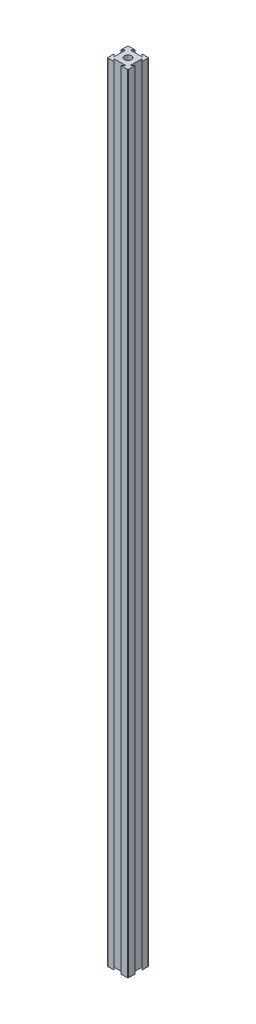
ISO-10303-21;
HEADER;
FILE_DESCRIPTION(('STEP AP214'),'2;1');
FILE_NAME('part.step','',(''),(''),'','','');
FILE_SCHEMA(('AUTOMOTIVE_DESIGN { 1 0 10303 214 1 1 1 1 }'));
ENDSEC;
DATA;
#1=APPLICATION_CONTEXT('core data for automotive mechanical design processes');
#2=APPLICATION_PROTOCOL_DEFINITION('international standard','automotive_design',2000,#1);
#3=PRODUCT_CONTEXT('',#1,'mechanical');
#4=PRODUCT('Part','Part','',(#3));
#5=PRODUCT_RELATED_PRODUCT_CATEGORY('part','',(#4));
#6=PRODUCT_DEFINITION_FORMATION('','',#4);
#7=PRODUCT_DEFINITION_CONTEXT('part definition',#1,'design');
#8=PRODUCT_DEFINITION('design','',#6,#7);
#9=PRODUCT_DEFINITION_SHAPE('','',#8);
#10=(LENGTH_UNIT() NAMED_UNIT(*) SI_UNIT(.MILLI.,.METRE.));
#11=(NAMED_UNIT(*) PLANE_ANGLE_UNIT() SI_UNIT($,.RADIAN.));
#12=(NAMED_UNIT(*) SI_UNIT($,.STERADIAN.) SOLID_ANGLE_UNIT());
#13=UNCERTAINTY_MEASURE_WITH_UNIT(LENGTH_MEASURE(1.E-05),#10,'distance_accuracy_value','');
#14=(GEOMETRIC_REPRESENTATION_CONTEXT(3) GLOBAL_UNCERTAINTY_ASSIGNED_CONTEXT((#13)) GLOBAL_UNIT_ASSIGNED_CONTEXT((#10,
#11,#12)) REPRESENTATION_CONTEXT('',''));
#15=CARTESIAN_POINT('',(0.,0.,0.));
#16=DIRECTION('',(0.,0.,1.));
#17=DIRECTION('',(1.,0.,0.));
#18=AXIS2_PLACEMENT_3D('',#15,#16,#17);
#19=CARTESIAN_POINT('',(16.6666666666667,762.,-16.6666666666667));
#20=DIRECTION('',(-0.707106781186547,0.,0.707106781186548));
#21=DIRECTION('',(0.707106781186548,0.,0.707106781186547));
#22=AXIS2_PLACEMENT_3D('',#19,#20,#21);
#23=PLANE('',#22);
#24=DIRECTION('',(-0.707106781186548,0.,-0.707106781186547));
#25=VECTOR('',#24,1.);
#26=CARTESIAN_POINT('',(16.6666666666667,0.,-16.6666666666667));
#27=LINE('',#26,#25);
#28=CARTESIAN_POINT('',(20.,0.,-13.3333333333333));
#29=VERTEX_POINT('',#28);
#30=CARTESIAN_POINT('',(17.6183333333333,0.,-15.715));
#31=VERTEX_POINT('',#30);
#32=EDGE_CURVE('E201',#29,#31,#27,.T.);
#33=ORIENTED_EDGE('',*,*,#32,.F.);
#34=DIRECTION('',(0.,-1.,0.));
#35=VECTOR('',#34,1.);
#36=CARTESIAN_POINT('',(20.,762.,-13.3333333333333));
#37=LINE('',#36,#35);
#38=CARTESIAN_POINT('',(20.,762.,-13.3333333333333));
#39=VERTEX_POINT('',#38);
#40=EDGE_CURVE('E195',#39,#29,#37,.T.);
#41=ORIENTED_EDGE('',*,*,#40,.F.);
#42=DIRECTION('',(-0.707106781186548,0.,-0.707106781186547));
#43=VECTOR('',#42,1.);
#44=CARTESIAN_POINT('',(16.6666666666667,762.,-16.6666666666667));
#45=LINE('',#44,#43);
#46=CARTESIAN_POINT('',(17.6183333333333,762.,-15.715));
#47=VERTEX_POINT('',#46);
#48=EDGE_CURVE('E198',#39,#47,#45,.T.);
#49=ORIENTED_EDGE('',*,*,#48,.T.);
#50=DIRECTION('',(0.,-1.,0.));
#51=VECTOR('',#50,1.);
#52=CARTESIAN_POINT('',(17.6183333333333,762.,-15.715));
#53=LINE('',#52,#51);
#54=EDGE_CURVE('E269',#47,#31,#53,.T.);
#55=ORIENTED_EDGE('',*,*,#54,.T.);
#56=EDGE_LOOP('',(#33,#41,#49,#55));
#57=FACE_BOUND('',#56,.T.);
#58=ADVANCED_FACE('F35',(#57),#23,.T.);
#59=CARTESIAN_POINT('',(20.,762.,0.));
#60=DIRECTION('',(-1.,0.,0.));
#61=DIRECTION('',(0.,0.,1.));
#62=AXIS2_PLACEMENT_3D('',#59,#60,#61);
#63=PLANE('',#62);
#64=DIRECTION('',(0.,0.,-1.));
#65=VECTOR('',#64,1.);
#66=CARTESIAN_POINT('',(20.,0.,0.));
#67=LINE('',#66,#65);
#68=CARTESIAN_POINT('',(20.,0.,-19.492));
#69=VERTEX_POINT('',#68);
#70=EDGE_CURVE('E274',#29,#69,#67,.T.);
#71=ORIENTED_EDGE('',*,*,#70,.T.);
#72=DIRECTION('',(0.,-1.,0.));
#73=VECTOR('',#72,1.);
#74=CARTESIAN_POINT('',(20.,762.,-19.492));
#75=LINE('',#74,#73);
#76=CARTESIAN_POINT('',(20.,762.,-19.492));
#77=VERTEX_POINT('',#76);
#78=EDGE_CURVE('E212',#69,#77,#75,.F.);
#79=ORIENTED_EDGE('',*,*,#78,.T.);
#80=DIRECTION('',(0.,0.,-1.));
#81=VECTOR('',#80,1.);
#82=CARTESIAN_POINT('',(20.,762.,0.));
#83=LINE('',#82,#81);
#84=EDGE_CURVE('E209',#39,#77,#83,.T.);
#85=ORIENTED_EDGE('',*,*,#84,.F.);
#86=ORIENTED_EDGE('',*,*,#40,.T.);
#87=EDGE_LOOP('',(#71,#79,#85,#86));
#88=FACE_BOUND('',#87,.T.);
#89=ADVANCED_FACE('F210',(#88),#63,.F.);
#90=CARTESIAN_POINT('',(0.,762.,-20.));
#91=DIRECTION('',(0.,0.,-1.));
#92=DIRECTION('',(-1.,0.,0.));
#93=AXIS2_PLACEMENT_3D('',#90,#91,#92);
#94=PLANE('',#93);
#95=DIRECTION('',(1.,0.,0.));
#96=VECTOR('',#95,1.);
#97=CARTESIAN_POINT('',(0.,762.,-20.));
#98=LINE('',#97,#96);
#99=CARTESIAN_POINT('',(13.3333333333333,762.,-20.));
#100=VERTEX_POINT('',#99);
#101=CARTESIAN_POINT('',(19.492,762.,-20.));
#102=VERTEX_POINT('',#101);
#103=EDGE_CURVE('E214',#100,#102,#98,.T.);
#104=ORIENTED_EDGE('',*,*,#103,.T.);
#105=DIRECTION('',(0.,-1.,0.));
#106=VECTOR('',#105,1.);
#107=CARTESIAN_POINT('',(19.492,0.,-20.));
#108=LINE('',#107,#106);
#109=CARTESIAN_POINT('',(19.492,0.,-20.));
#110=VERTEX_POINT('',#109);
#111=EDGE_CURVE('E376',#102,#110,#108,.T.);
#112=ORIENTED_EDGE('',*,*,#111,.T.);
#113=DIRECTION('',(1.,0.,0.));
#114=VECTOR('',#113,1.);
#115=CARTESIAN_POINT('',(0.,0.,-20.));
#116=LINE('',#115,#114);
#117=CARTESIAN_POINT('',(13.3333333333333,0.,-20.));
#118=VERTEX_POINT('',#117);
#119=EDGE_CURVE('E276',#118,#110,#116,.T.);
#120=ORIENTED_EDGE('',*,*,#119,.F.);
#121=DIRECTION('',(0.,-1.,0.));
#122=VECTOR('',#121,1.);
#123=CARTESIAN_POINT('',(13.3333333333333,762.,-20.));
#124=LINE('',#123,#122);
#125=EDGE_CURVE('E206',#100,#118,#124,.T.);
#126=ORIENTED_EDGE('',*,*,#125,.F.);
#127=EDGE_LOOP('',(#104,#112,#120,#126));
#128=FACE_BOUND('',#127,.T.);
#129=ADVANCED_FACE('F408',(#128),#94,.T.);
#130=CARTESIAN_POINT('',(16.6666666666666,762.,-16.6666666666668));
#131=DIRECTION('',(-0.707106781186544,0.,0.707106781186551));
#132=DIRECTION('',(0.707106781186551,0.,0.707106781186544));
#133=AXIS2_PLACEMENT_3D('',#130,#131,#132);
#134=PLANE('',#133);
#135=DIRECTION('',(-0.707106781186551,0.,-0.707106781186544));
#136=VECTOR('',#135,1.);
#137=CARTESIAN_POINT('',(16.6666666666666,0.,-16.6666666666668));
#138=LINE('',#137,#136);
#139=CARTESIAN_POINT('',(15.715,0.,-17.6183333333334));
#140=VERTEX_POINT('',#139);
#141=EDGE_CURVE('E280',#140,#118,#138,.T.);
#142=ORIENTED_EDGE('',*,*,#141,.F.);
#143=DIRECTION('',(0.,-1.,0.));
#144=VECTOR('',#143,1.);
#145=CARTESIAN_POINT('',(15.715,762.,-17.6183333333334));
#146=LINE('',#145,#144);
#147=CARTESIAN_POINT('',(15.715,762.,-17.6183333333334));
#148=VERTEX_POINT('',#147);
#149=EDGE_CURVE('E354',#148,#140,#146,.T.);
#150=ORIENTED_EDGE('',*,*,#149,.F.);
#151=DIRECTION('',(-0.707106781186551,0.,-0.707106781186544));
#152=VECTOR('',#151,1.);
#153=CARTESIAN_POINT('',(16.6666666666666,762.,-16.6666666666668));
#154=LINE('',#153,#152);
#155=EDGE_CURVE('E230',#148,#100,#154,.T.);
#156=ORIENTED_EDGE('',*,*,#155,.T.);
#157=ORIENTED_EDGE('',*,*,#125,.T.);
#158=EDGE_LOOP('',(#142,#150,#156,#157));
#159=FACE_BOUND('',#158,.T.);
#160=ADVANCED_FACE('F412',(#159),#134,.T.);
#161=CARTESIAN_POINT('',(0.,762.,-17.6183333333334));
#162=DIRECTION('',(0.,0.,-1.));
#163=DIRECTION('',(-1.,0.,0.));
#164=AXIS2_PLACEMENT_3D('',#161,#162,#163);
#165=PLANE('',#164);
#166=DIRECTION('',(1.,0.,0.));
#167=VECTOR('',#166,1.);
#168=CARTESIAN_POINT('',(0.,0.,-17.6183333333334));
#169=LINE('',#168,#167);
#170=CARTESIAN_POINT('',(4.285,0.,-17.6183333333334));
#171=VERTEX_POINT('',#170);
#172=EDGE_CURVE('E284',#171,#140,#169,.T.);
#173=ORIENTED_EDGE('',*,*,#172,.F.);
#174=DIRECTION('',(0.,-1.,0.));
#175=VECTOR('',#174,1.);
#176=CARTESIAN_POINT('',(4.285,762.,-17.6183333333334));
#177=LINE('',#176,#175);
#178=CARTESIAN_POINT('',(4.285,762.,-17.6183333333334));
#179=VERTEX_POINT('',#178);
#180=EDGE_CURVE('E352',#179,#171,#177,.T.);
#181=ORIENTED_EDGE('',*,*,#180,.F.);
#182=DIRECTION('',(1.,0.,0.));
#183=VECTOR('',#182,1.);
#184=CARTESIAN_POINT('',(0.,762.,-17.6183333333334));
#185=LINE('',#184,#183);
#186=EDGE_CURVE('E234',#179,#148,#185,.T.);
#187=ORIENTED_EDGE('',*,*,#186,.T.);
#188=ORIENTED_EDGE('',*,*,#149,.T.);
#189=EDGE_LOOP('',(#173,#181,#187,#188));
#190=FACE_BOUND('',#189,.T.);
#191=ADVANCED_FACE('F439',(#190),#165,.T.);
#192=CARTESIAN_POINT('',(-6.6666666666667,762.,-6.66666666666677));
#193=DIRECTION('',(0.707106781186544,0.,0.707106781186551));
#194=DIRECTION('',(0.707106781186551,0.,-0.707106781186544));
#195=AXIS2_PLACEMENT_3D('',#192,#193,#194);
#196=PLANE('',#195);
#197=DIRECTION('',(-0.707106781186551,0.,0.707106781186544));
#198=VECTOR('',#197,1.);
#199=CARTESIAN_POINT('',(-6.6666666666667,0.,-6.66666666666677));
#200=LINE('',#199,#198);
#201=CARTESIAN_POINT('',(6.66666666666666,0.,-20.));
#202=VERTEX_POINT('',#201);
#203=EDGE_CURVE('E287',#202,#171,#200,.T.);
#204=ORIENTED_EDGE('',*,*,#203,.F.);
#205=DIRECTION('',(0.,-1.,0.));
#206=VECTOR('',#205,1.);
#207=CARTESIAN_POINT('',(6.66666666666666,762.,-20.));
#208=LINE('',#207,#206);
#209=CARTESIAN_POINT('',(6.66666666666666,762.,-20.));
#210=VERTEX_POINT('',#209);
#211=EDGE_CURVE('E349',#210,#202,#208,.T.);
#212=ORIENTED_EDGE('',*,*,#211,.F.);
#213=DIRECTION('',(-0.707106781186551,0.,0.707106781186544));
#214=VECTOR('',#213,1.);
#215=CARTESIAN_POINT('',(-6.6666666666667,762.,-6.66666666666677));
#216=LINE('',#215,#214);
#217=EDGE_CURVE('E237',#210,#179,#216,.T.);
#218=ORIENTED_EDGE('',*,*,#217,.T.);
#219=ORIENTED_EDGE('',*,*,#180,.T.);
#220=EDGE_LOOP('',(#204,#212,#218,#219));
#221=FACE_BOUND('',#220,.T.);
#222=ADVANCED_FACE('F442',(#221),#196,.T.);
#223=CARTESIAN_POINT('',(0.508,0.,-20.));
#224=VERTEX_POINT('',#223);
#225=EDGE_CURVE('E281',#224,#202,#116,.T.);
#226=ORIENTED_EDGE('',*,*,#225,.F.);
#227=DIRECTION('',(0.,-1.,0.));
#228=VECTOR('',#227,1.);
#229=CARTESIAN_POINT('',(0.508,762.,-20.));
#230=LINE('',#229,#228);
#231=CARTESIAN_POINT('',(0.508,762.,-20.));
#232=VERTEX_POINT('',#231);
#233=EDGE_CURVE('E367',#224,#232,#230,.F.);
#234=ORIENTED_EDGE('',*,*,#233,.T.);
#235=EDGE_CURVE('E231',#232,#210,#98,.T.);
#236=ORIENTED_EDGE('',*,*,#235,.T.);
#237=ORIENTED_EDGE('',*,*,#211,.T.);
#238=EDGE_LOOP('',(#226,#234,#236,#237));
#239=FACE_BOUND('',#238,.T.);
#240=ADVANCED_FACE('F505',(#239),#94,.T.);
#241=CARTESIAN_POINT('',(0.,762.,0.));
#242=DIRECTION('',(-1.,0.,0.));
#243=DIRECTION('',(0.,0.,1.));
#244=AXIS2_PLACEMENT_3D('',#241,#242,#243);
#245=PLANE('',#244);
#246=DIRECTION('',(0.,0.,-1.));
#247=VECTOR('',#246,1.);
#248=CARTESIAN_POINT('',(0.,762.,0.));
#249=LINE('',#248,#247);
#250=CARTESIAN_POINT('',(0.,762.,-13.3333333333333));
#251=VERTEX_POINT('',#250);
#252=CARTESIAN_POINT('',(0.,762.,-19.492));
#253=VERTEX_POINT('',#252);
#254=EDGE_CURVE('E240',#251,#253,#249,.T.);
#255=ORIENTED_EDGE('',*,*,#254,.T.);
#256=DIRECTION('',(0.,-1.,0.));
#257=VECTOR('',#256,1.);
#258=CARTESIAN_POINT('',(0.,762.,-19.492));
#259=LINE('',#258,#257);
#260=CARTESIAN_POINT('',(0.,0.,-19.492));
#261=VERTEX_POINT('',#260);
#262=EDGE_CURVE('E205',#253,#261,#259,.T.);
#263=ORIENTED_EDGE('',*,*,#262,.T.);
#264=DIRECTION('',(0.,0.,-1.));
#265=VECTOR('',#264,1.);
#266=CARTESIAN_POINT('',(0.,0.,0.));
#267=LINE('',#266,#265);
#268=CARTESIAN_POINT('',(0.,0.,-13.3333333333333));
#269=VERTEX_POINT('',#268);
#270=EDGE_CURVE('E290',#269,#261,#267,.T.);
#271=ORIENTED_EDGE('',*,*,#270,.F.);
#272=DIRECTION('',(0.,-1.,0.));
#273=VECTOR('',#272,1.);
#274=CARTESIAN_POINT('',(0.,762.,-13.3333333333333));
#275=LINE('',#274,#273);
#276=EDGE_CURVE('E347',#251,#269,#275,.T.);
#277=ORIENTED_EDGE('',*,*,#276,.F.);
#278=EDGE_LOOP('',(#255,#263,#271,#277));
#279=FACE_BOUND('',#278,.T.);
#280=ADVANCED_FACE('F451',(#279),#245,.T.);
#281=CARTESIAN_POINT('',(-6.66666666666667,762.,-6.66666666666669));
#282=DIRECTION('',(-0.707106781186547,0.,-0.707106781186549));
#283=DIRECTION('',(-0.707106781186549,0.,0.707106781186547));
#284=AXIS2_PLACEMENT_3D('',#281,#282,#283);
#285=PLANE('',#284);
#286=DIRECTION('',(0.707106781186549,0.,-0.707106781186547));
#287=VECTOR('',#286,1.);
#288=CARTESIAN_POINT('',(-6.66666666666667,0.,-6.66666666666669));
#289=LINE('',#288,#287);
#290=CARTESIAN_POINT('',(2.38166666666667,0.,-15.715));
#291=VERTEX_POINT('',#290);
#292=EDGE_CURVE('E293',#269,#291,#289,.T.);
#293=ORIENTED_EDGE('',*,*,#292,.T.);
#294=DIRECTION('',(0.,-1.,0.));
#295=VECTOR('',#294,1.);
#296=CARTESIAN_POINT('',(2.38166666666667,762.,-15.715));
#297=LINE('',#296,#295);
#298=CARTESIAN_POINT('',(2.38166666666667,762.,-15.715));
#299=VERTEX_POINT('',#298);
#300=EDGE_CURVE('E344',#299,#291,#297,.T.);
#301=ORIENTED_EDGE('',*,*,#300,.F.);
#302=DIRECTION('',(0.707106781186549,0.,-0.707106781186547));
#303=VECTOR('',#302,1.);
#304=CARTESIAN_POINT('',(-6.66666666666667,762.,-6.66666666666669));
#305=LINE('',#304,#303);
#306=EDGE_CURVE('E243',#251,#299,#305,.T.);
#307=ORIENTED_EDGE('',*,*,#306,.F.);
#308=ORIENTED_EDGE('',*,*,#276,.T.);
#309=EDGE_LOOP('',(#293,#301,#307,#308));
#310=FACE_BOUND('',#309,.T.);
#311=ADVANCED_FACE('F456',(#310),#285,.F.);
#312=CARTESIAN_POINT('',(2.38166666666667,762.,0.));
#313=DIRECTION('',(1.,0.,0.));
#314=DIRECTION('',(0.,0.,-1.));
#315=AXIS2_PLACEMENT_3D('',#312,#313,#314);
#316=PLANE('',#315);
#317=DIRECTION('',(0.,0.,1.));
#318=VECTOR('',#317,1.);
#319=CARTESIAN_POINT('',(2.38166666666667,0.,0.));
#320=LINE('',#319,#318);
#321=CARTESIAN_POINT('',(2.38166666666667,0.,-4.285));
#322=VERTEX_POINT('',#321);
#323=EDGE_CURVE('E297',#291,#322,#320,.T.);
#324=ORIENTED_EDGE('',*,*,#323,.T.);
#325=DIRECTION('',(0.,-1.,0.));
#326=VECTOR('',#325,1.);
#327=CARTESIAN_POINT('',(2.38166666666667,762.,-4.285));
#328=LINE('',#327,#326);
#329=CARTESIAN_POINT('',(2.38166666666667,762.,-4.285));
#330=VERTEX_POINT('',#329);
#331=EDGE_CURVE('E341',#330,#322,#328,.T.);
#332=ORIENTED_EDGE('',*,*,#331,.F.);
#333=DIRECTION('',(0.,0.,1.));
#334=VECTOR('',#333,1.);
#335=CARTESIAN_POINT('',(2.38166666666667,762.,0.));
#336=LINE('',#335,#334);
#337=EDGE_CURVE('E247',#299,#330,#336,.T.);
#338=ORIENTED_EDGE('',*,*,#337,.F.);
#339=ORIENTED_EDGE('',*,*,#300,.T.);
#340=EDGE_LOOP('',(#324,#332,#338,#339));
#341=FACE_BOUND('',#340,.T.);
#342=ADVANCED_FACE('F462',(#341),#316,.F.);
#343=CARTESIAN_POINT('',(3.33333333333333,762.,-3.33333333333335));
#344=DIRECTION('',(-0.707106781186546,0.,0.707106781186549));
#345=DIRECTION('',(0.707106781186549,0.,0.707106781186546));
#346=AXIS2_PLACEMENT_3D('',#343,#344,#345);
#347=PLANE('',#346);
#348=DIRECTION('',(-0.707106781186549,0.,-0.707106781186546));
#349=VECTOR('',#348,1.);
#350=CARTESIAN_POINT('',(3.33333333333333,0.,-3.33333333333335));
#351=LINE('',#350,#349);
#352=CARTESIAN_POINT('',(0.,0.,-6.66666666666667));
#353=VERTEX_POINT('',#352);
#354=EDGE_CURVE('E300',#322,#353,#351,.T.);
#355=ORIENTED_EDGE('',*,*,#354,.T.);
#356=DIRECTION('',(0.,-1.,0.));
#357=VECTOR('',#356,1.);
#358=CARTESIAN_POINT('',(0.,762.,-6.66666666666667));
#359=LINE('',#358,#357);
#360=CARTESIAN_POINT('',(0.,762.,-6.66666666666667));
#361=VERTEX_POINT('',#360);
#362=EDGE_CURVE('E338',#361,#353,#359,.T.);
#363=ORIENTED_EDGE('',*,*,#362,.F.);
#364=DIRECTION('',(-0.707106781186549,0.,-0.707106781186546));
#365=VECTOR('',#364,1.);
#366=CARTESIAN_POINT('',(3.33333333333333,762.,-3.33333333333335));
#367=LINE('',#366,#365);
#368=EDGE_CURVE('E250',#330,#361,#367,.T.);
#369=ORIENTED_EDGE('',*,*,#368,.F.);
#370=ORIENTED_EDGE('',*,*,#331,.T.);
#371=EDGE_LOOP('',(#355,#363,#369,#370));
#372=FACE_BOUND('',#371,.T.);
#373=ADVANCED_FACE('F464',(#372),#347,.F.);
#374=CARTESIAN_POINT('',(0.,0.,-0.508));
#375=VERTEX_POINT('',#374);
#376=EDGE_CURVE('E294',#375,#353,#267,.T.);
#377=ORIENTED_EDGE('',*,*,#376,.F.);
#378=DIRECTION('',(0.,-1.,0.));
#379=VECTOR('',#378,1.);
#380=CARTESIAN_POINT('',(0.,762.,-0.508));
#381=LINE('',#380,#379);
#382=CARTESIAN_POINT('',(0.,762.,-0.508));
#383=VERTEX_POINT('',#382);
#384=EDGE_CURVE('E383',#375,#383,#381,.F.);
#385=ORIENTED_EDGE('',*,*,#384,.T.);
#386=EDGE_CURVE('E244',#383,#361,#249,.T.);
#387=ORIENTED_EDGE('',*,*,#386,.T.);
#388=ORIENTED_EDGE('',*,*,#362,.T.);
#389=EDGE_LOOP('',(#377,#385,#387,#388));
#390=FACE_BOUND('',#389,.T.);
#391=ADVANCED_FACE('F467',(#390),#245,.T.);
#392=CARTESIAN_POINT('',(0.,762.,0.));
#393=DIRECTION('',(0.,0.,-1.));
#394=DIRECTION('',(-1.,0.,0.));
#395=AXIS2_PLACEMENT_3D('',#392,#393,#394);
#396=PLANE('',#395);
#397=DIRECTION('',(1.,0.,0.));
#398=VECTOR('',#397,1.);
#399=CARTESIAN_POINT('',(0.,762.,0.));
#400=LINE('',#399,#398);
#401=CARTESIAN_POINT('',(0.508,762.,0.));
#402=VERTEX_POINT('',#401);
#403=CARTESIAN_POINT('',(6.66666666666667,762.,0.));
#404=VERTEX_POINT('',#403);
#405=EDGE_CURVE('E253',#402,#404,#400,.T.);
#406=ORIENTED_EDGE('',*,*,#405,.F.);
#407=DIRECTION('',(0.,-1.,0.));
#408=VECTOR('',#407,1.);
#409=CARTESIAN_POINT('',(0.508,0.,0.));
#410=LINE('',#409,#408);
#411=CARTESIAN_POINT('',(0.508,0.,0.));
#412=VERTEX_POINT('',#411);
#413=EDGE_CURVE('E380',#402,#412,#410,.T.);
#414=ORIENTED_EDGE('',*,*,#413,.T.);
#415=DIRECTION('',(1.,0.,0.));
#416=VECTOR('',#415,1.);
#417=CARTESIAN_POINT('',(0.,0.,0.));
#418=LINE('',#417,#416);
#419=CARTESIAN_POINT('',(6.66666666666667,0.,0.));
#420=VERTEX_POINT('',#419);
#421=EDGE_CURVE('E303',#412,#420,#418,.T.);
#422=ORIENTED_EDGE('',*,*,#421,.T.);
#423=DIRECTION('',(0.,-1.,0.));
#424=VECTOR('',#423,1.);
#425=CARTESIAN_POINT('',(6.66666666666667,762.,0.));
#426=LINE('',#425,#424);
#427=EDGE_CURVE('E335',#404,#420,#426,.T.);
#428=ORIENTED_EDGE('',*,*,#427,.F.);
#429=EDGE_LOOP('',(#406,#414,#422,#428));
#430=FACE_BOUND('',#429,.T.);
#431=ADVANCED_FACE('F474',(#430),#396,.F.);
#432=CARTESIAN_POINT('',(3.3333333333333,762.,-3.33333333333333));
#433=DIRECTION('',(-0.707106781186544,0.,0.707106781186551));
#434=DIRECTION('',(0.707106781186551,0.,0.707106781186544));
#435=AXIS2_PLACEMENT_3D('',#432,#433,#434);
#436=PLANE('',#435);
#437=DIRECTION('',(-0.707106781186551,0.,-0.707106781186544));
#438=VECTOR('',#437,1.);
#439=CARTESIAN_POINT('',(3.3333333333333,0.,-3.33333333333333));
#440=LINE('',#439,#438);
#441=CARTESIAN_POINT('',(4.285,0.,-2.38166666666664));
#442=VERTEX_POINT('',#441);
#443=EDGE_CURVE('E305',#420,#442,#440,.T.);
#444=ORIENTED_EDGE('',*,*,#443,.T.);
#445=DIRECTION('',(0.,-1.,0.));
#446=VECTOR('',#445,1.);
#447=CARTESIAN_POINT('',(4.285,762.,-2.38166666666664));
#448=LINE('',#447,#446);
#449=CARTESIAN_POINT('',(4.285,762.,-2.38166666666664));
#450=VERTEX_POINT('',#449);
#451=EDGE_CURVE('E332',#450,#442,#448,.T.);
#452=ORIENTED_EDGE('',*,*,#451,.F.);
#453=DIRECTION('',(-0.707106781186551,0.,-0.707106781186544));
#454=VECTOR('',#453,1.);
#455=CARTESIAN_POINT('',(3.3333333333333,762.,-3.33333333333333));
#456=LINE('',#455,#454);
#457=EDGE_CURVE('E255',#404,#450,#456,.T.);
#458=ORIENTED_EDGE('',*,*,#457,.F.);
#459=ORIENTED_EDGE('',*,*,#427,.T.);
#460=EDGE_LOOP('',(#444,#452,#458,#459));
#461=FACE_BOUND('',#460,.T.);
#462=ADVANCED_FACE('F480',(#461),#436,.F.);
#463=CARTESIAN_POINT('',(0.,762.,-2.38166666666664));
#464=DIRECTION('',(0.,0.,-1.));
#465=DIRECTION('',(-1.,0.,0.));
#466=AXIS2_PLACEMENT_3D('',#463,#464,#465);
#467=PLANE('',#466);
#468=DIRECTION('',(1.,0.,0.));
#469=VECTOR('',#468,1.);
#470=CARTESIAN_POINT('',(0.,0.,-2.38166666666664));
#471=LINE('',#470,#469);
#472=CARTESIAN_POINT('',(15.715,0.,-2.38166666666664));
#473=VERTEX_POINT('',#472);
#474=EDGE_CURVE('E309',#442,#473,#471,.T.);
#475=ORIENTED_EDGE('',*,*,#474,.T.);
#476=DIRECTION('',(0.,-1.,0.));
#477=VECTOR('',#476,1.);
#478=CARTESIAN_POINT('',(15.715,762.,-2.38166666666664));
#479=LINE('',#478,#477);
#480=CARTESIAN_POINT('',(15.715,762.,-2.38166666666664));
#481=VERTEX_POINT('',#480);
#482=EDGE_CURVE('E329',#481,#473,#479,.T.);
#483=ORIENTED_EDGE('',*,*,#482,.F.);
#484=DIRECTION('',(1.,0.,0.));
#485=VECTOR('',#484,1.);
#486=CARTESIAN_POINT('',(0.,762.,-2.38166666666664));
#487=LINE('',#486,#485);
#488=EDGE_CURVE('E259',#450,#481,#487,.T.);
#489=ORIENTED_EDGE('',*,*,#488,.F.);
#490=ORIENTED_EDGE('',*,*,#451,.T.);
#491=EDGE_LOOP('',(#475,#483,#489,#490));
#492=FACE_BOUND('',#491,.T.);
#493=ADVANCED_FACE('F483',(#492),#467,.F.);
#494=CARTESIAN_POINT('',(6.66666666666659,762.,6.66666666666667));
#495=DIRECTION('',(0.707106781186544,0.,0.707106781186551));
#496=DIRECTION('',(0.707106781186551,0.,-0.707106781186544));
#497=AXIS2_PLACEMENT_3D('',#494,#495,#496);
#498=PLANE('',#497);
#499=DIRECTION('',(-0.707106781186551,0.,0.707106781186544));
#500=VECTOR('',#499,1.);
#501=CARTESIAN_POINT('',(6.66666666666659,0.,6.66666666666667));
#502=LINE('',#501,#500);
#503=CARTESIAN_POINT('',(13.3333333333333,0.,0.));
#504=VERTEX_POINT('',#503);
#505=EDGE_CURVE('E312',#473,#504,#502,.T.);
#506=ORIENTED_EDGE('',*,*,#505,.T.);
#507=DIRECTION('',(0.,-1.,0.));
#508=VECTOR('',#507,1.);
#509=CARTESIAN_POINT('',(13.3333333333333,762.,0.));
#510=LINE('',#509,#508);
#511=CARTESIAN_POINT('',(13.3333333333333,762.,0.));
#512=VERTEX_POINT('',#511);
#513=EDGE_CURVE('E326',#512,#504,#510,.T.);
#514=ORIENTED_EDGE('',*,*,#513,.F.);
#515=DIRECTION('',(-0.707106781186551,0.,0.707106781186544));
#516=VECTOR('',#515,1.);
#517=CARTESIAN_POINT('',(6.66666666666659,762.,6.66666666666667));
#518=LINE('',#517,#516);
#519=EDGE_CURVE('E262',#481,#512,#518,.T.);
#520=ORIENTED_EDGE('',*,*,#519,.F.);
#521=ORIENTED_EDGE('',*,*,#482,.T.);
#522=EDGE_LOOP('',(#506,#514,#520,#521));
#523=FACE_BOUND('',#522,.T.);
#524=ADVANCED_FACE('F485',(#523),#498,.F.);
#525=CARTESIAN_POINT('',(19.492,0.,0.));
#526=VERTEX_POINT('',#525);
#527=EDGE_CURVE('E306',#504,#526,#418,.T.);
#528=ORIENTED_EDGE('',*,*,#527,.T.);
#529=DIRECTION('',(0.,-1.,0.));
#530=VECTOR('',#529,1.);
#531=CARTESIAN_POINT('',(19.492,762.,0.));
#532=LINE('',#531,#530);
#533=CARTESIAN_POINT('',(19.492,762.,0.));
#534=VERTEX_POINT('',#533);
#535=EDGE_CURVE('E11',#526,#534,#532,.F.);
#536=ORIENTED_EDGE('',*,*,#535,.T.);
#537=EDGE_CURVE('E256',#512,#534,#400,.T.);
#538=ORIENTED_EDGE('',*,*,#537,.F.);
#539=ORIENTED_EDGE('',*,*,#513,.T.);
#540=EDGE_LOOP('',(#528,#536,#538,#539));
#541=FACE_BOUND('',#540,.T.);
#542=ADVANCED_FACE('F394',(#541),#396,.F.);
#543=CARTESIAN_POINT('',(20.,762.,-0.508));
#544=VERTEX_POINT('',#543);
#545=CARTESIAN_POINT('',(20.,762.,-6.66666666666667));
#546=VERTEX_POINT('',#545);
#547=EDGE_CURVE('E216',#544,#546,#83,.T.);
#548=ORIENTED_EDGE('',*,*,#547,.F.);
#549=DIRECTION('',(0.,-1.,0.));
#550=VECTOR('',#549,1.);
#551=CARTESIAN_POINT('',(20.,762.,-0.508));
#552=LINE('',#551,#550);
#553=CARTESIAN_POINT('',(20.,0.,-0.508));
#554=VERTEX_POINT('',#553);
#555=EDGE_CURVE('E43',#544,#554,#552,.T.);
#556=ORIENTED_EDGE('',*,*,#555,.T.);
#557=CARTESIAN_POINT('',(20.,0.,-6.66666666666667));
#558=VERTEX_POINT('',#557);
#559=EDGE_CURVE('E277',#554,#558,#67,.T.);
#560=ORIENTED_EDGE('',*,*,#559,.T.);
#561=DIRECTION('',(0.,-1.,0.));
#562=VECTOR('',#561,1.);
#563=CARTESIAN_POINT('',(20.,762.,-6.66666666666667));
#564=LINE('',#563,#562);
#565=EDGE_CURVE('E323',#546,#558,#564,.T.);
#566=ORIENTED_EDGE('',*,*,#565,.F.);
#567=EDGE_LOOP('',(#548,#556,#560,#566));
#568=FACE_BOUND('',#567,.T.);
#569=ADVANCED_FACE('F388',(#568),#63,.F.);
#570=CARTESIAN_POINT('',(6.66666666666663,762.,6.66666666666666));
#571=DIRECTION('',(-0.707106781186546,0.,-0.707106781186549));
#572=DIRECTION('',(-0.707106781186549,0.,0.707106781186546));
#573=AXIS2_PLACEMENT_3D('',#570,#571,#572);
#574=PLANE('',#573);
#575=DIRECTION('',(0.707106781186549,0.,-0.707106781186546));
#576=VECTOR('',#575,1.);
#577=CARTESIAN_POINT('',(6.66666666666663,0.,6.66666666666666));
#578=LINE('',#577,#576);
#579=CARTESIAN_POINT('',(17.6183333333333,0.,-4.285));
#580=VERTEX_POINT('',#579);
#581=EDGE_CURVE('E315',#580,#558,#578,.T.);
#582=ORIENTED_EDGE('',*,*,#581,.F.);
#583=DIRECTION('',(0.,-1.,0.));
#584=VECTOR('',#583,1.);
#585=CARTESIAN_POINT('',(17.6183333333333,762.,-4.285));
#586=LINE('',#585,#584);
#587=CARTESIAN_POINT('',(17.6183333333333,762.,-4.285));
#588=VERTEX_POINT('',#587);
#589=EDGE_CURVE('E321',#588,#580,#586,.T.);
#590=ORIENTED_EDGE('',*,*,#589,.F.);
#591=DIRECTION('',(0.707106781186549,0.,-0.707106781186546));
#592=VECTOR('',#591,1.);
#593=CARTESIAN_POINT('',(6.66666666666663,762.,6.66666666666666));
#594=LINE('',#593,#592);
#595=EDGE_CURVE('E265',#588,#546,#594,.T.);
#596=ORIENTED_EDGE('',*,*,#595,.T.);
#597=ORIENTED_EDGE('',*,*,#565,.T.);
#598=EDGE_LOOP('',(#582,#590,#596,#597));
#599=FACE_BOUND('',#598,.T.);
#600=ADVANCED_FACE('F418',(#599),#574,.T.);
#601=CARTESIAN_POINT('',(10.,762.,-10.));
#602=DIRECTION('',(0.,-1.,0.));
#603=DIRECTION('',(0.,0.,-1.));
#604=AXIS2_PLACEMENT_3D('',#601,#602,#603);
#605=CYLINDRICAL_SURFACE('',#604,3.33333333333333);
#606=CARTESIAN_POINT('',(10.,762.,-10.));
#607=DIRECTION('',(0.,1.,0.));
#608=DIRECTION('',(0.,0.,1.));
#609=AXIS2_PLACEMENT_3D('',#606,#607,#608);
#610=CIRCLE('',#609,3.33333333333333);
#611=CARTESIAN_POINT('',(10.,762.,-6.66666666666667));
#612=VERTEX_POINT('',#611);
#613=EDGE_CURVE('E222',#612,#612,#610,.T.);
#614=ORIENTED_EDGE('',*,*,#613,.T.);
#615=EDGE_LOOP('',(#614));
#616=FACE_BOUND('',#615,.T.);
#617=CARTESIAN_POINT('',(10.,0.,-10.));
#618=DIRECTION('',(0.,1.,0.));
#619=DIRECTION('',(0.,0.,1.));
#620=AXIS2_PLACEMENT_3D('',#617,#618,#619);
#621=CIRCLE('',#620,3.33333333333333);
#622=CARTESIAN_POINT('',(10.,0.,-6.66666666666667));
#623=VERTEX_POINT('',#622);
#624=EDGE_CURVE('E270',#623,#623,#621,.T.);
#625=ORIENTED_EDGE('',*,*,#624,.F.);
#626=EDGE_LOOP('',(#625));
#627=FACE_BOUND('',#626,.T.);
#628=ADVANCED_FACE('F414',(#616,#627),#605,.F.);
#629=CARTESIAN_POINT('',(17.6183333333333,762.,0.));
#630=DIRECTION('',(1.,0.,0.));
#631=DIRECTION('',(0.,0.,-1.));
#632=AXIS2_PLACEMENT_3D('',#629,#630,#631);
#633=PLANE('',#632);
#634=DIRECTION('',(0.,0.,1.));
#635=VECTOR('',#634,1.);
#636=CARTESIAN_POINT('',(17.6183333333333,0.,0.));
#637=LINE('',#636,#635);
#638=EDGE_CURVE('E225',#31,#580,#637,.T.);
#639=ORIENTED_EDGE('',*,*,#638,.F.);
#640=ORIENTED_EDGE('',*,*,#54,.F.);
#641=DIRECTION('',(0.,0.,1.));
#642=VECTOR('',#641,1.);
#643=CARTESIAN_POINT('',(17.6183333333333,762.,0.));
#644=LINE('',#643,#642);
#645=EDGE_CURVE('E221',#47,#588,#644,.T.);
#646=ORIENTED_EDGE('',*,*,#645,.T.);
#647=ORIENTED_EDGE('',*,*,#589,.T.);
#648=EDGE_LOOP('',(#639,#640,#646,#647));
#649=FACE_BOUND('',#648,.T.);
#650=ADVANCED_FACE('F417',(#649),#633,.T.);
#651=CARTESIAN_POINT('',(0.,762.,0.));
#652=DIRECTION('',(0.,1.,0.));
#653=DIRECTION('',(0.,0.,1.));
#654=AXIS2_PLACEMENT_3D('',#651,#652,#653);
#655=PLANE('',#654);
#656=ORIENTED_EDGE('',*,*,#613,.F.);
#657=EDGE_LOOP('',(#656));
#658=FACE_BOUND('',#657,.T.);
#659=ORIENTED_EDGE('',*,*,#235,.F.);
#660=CARTESIAN_POINT('',(0.508,762.,-19.492));
#661=DIRECTION('',(0.,1.,0.));
#662=DIRECTION('',(0.,0.,1.));
#663=AXIS2_PLACEMENT_3D('',#660,#661,#662);
#664=CIRCLE('',#663,0.508);
#665=EDGE_CURVE('E374',#232,#253,#664,.T.);
#666=ORIENTED_EDGE('',*,*,#665,.T.);
#667=ORIENTED_EDGE('',*,*,#254,.F.);
#668=ORIENTED_EDGE('',*,*,#306,.T.);
#669=ORIENTED_EDGE('',*,*,#337,.T.);
#670=ORIENTED_EDGE('',*,*,#368,.T.);
#671=ORIENTED_EDGE('',*,*,#386,.F.);
#672=CARTESIAN_POINT('',(0.508,762.,-0.508));
#673=DIRECTION('',(0.,1.,0.));
#674=DIRECTION('',(0.,0.,1.));
#675=AXIS2_PLACEMENT_3D('',#672,#673,#674);
#676=CIRCLE('',#675,0.508);
#677=EDGE_CURVE('E370',#383,#402,#676,.T.);
#678=ORIENTED_EDGE('',*,*,#677,.T.);
#679=ORIENTED_EDGE('',*,*,#405,.T.);
#680=ORIENTED_EDGE('',*,*,#457,.T.);
#681=ORIENTED_EDGE('',*,*,#488,.T.);
#682=ORIENTED_EDGE('',*,*,#519,.T.);
#683=ORIENTED_EDGE('',*,*,#537,.T.);
#684=CARTESIAN_POINT('',(19.492,762.,-0.508));
#685=DIRECTION('',(0.,1.,0.));
#686=DIRECTION('',(0.,0.,1.));
#687=AXIS2_PLACEMENT_3D('',#684,#685,#686);
#688=CIRCLE('',#687,0.508);
#689=EDGE_CURVE('E50',#534,#544,#688,.T.);
#690=ORIENTED_EDGE('',*,*,#689,.T.);
#691=ORIENTED_EDGE('',*,*,#547,.T.);
#692=ORIENTED_EDGE('',*,*,#595,.F.);
#693=ORIENTED_EDGE('',*,*,#645,.F.);
#694=ORIENTED_EDGE('',*,*,#48,.F.);
#695=ORIENTED_EDGE('',*,*,#84,.T.);
#696=CARTESIAN_POINT('',(19.492,762.,-19.492));
#697=DIRECTION('',(0.,1.,0.));
#698=DIRECTION('',(0.,0.,1.));
#699=AXIS2_PLACEMENT_3D('',#696,#697,#698);
#700=CIRCLE('',#699,0.508);
#701=EDGE_CURVE('E372',#77,#102,#700,.T.);
#702=ORIENTED_EDGE('',*,*,#701,.T.);
#703=ORIENTED_EDGE('',*,*,#103,.F.);
#704=ORIENTED_EDGE('',*,*,#155,.F.);
#705=ORIENTED_EDGE('',*,*,#186,.F.);
#706=ORIENTED_EDGE('',*,*,#217,.F.);
#707=EDGE_LOOP('',(#659,#666,#667,#668,#669,#670,#671,#678,#679,#680,#681,#682,#683,#690,#691,
#692,#693,#694,#695,#702,#703,#704,#705,#706));
#708=FACE_BOUND('',#707,.T.);
#709=ADVANCED_FACE('F218',(#658,#708),#655,.T.);
#710=CARTESIAN_POINT('',(0.,0.,0.));
#711=DIRECTION('',(0.,1.,0.));
#712=DIRECTION('',(0.,0.,1.));
#713=AXIS2_PLACEMENT_3D('',#710,#711,#712);
#714=PLANE('',#713);
#715=ORIENTED_EDGE('',*,*,#624,.T.);
#716=EDGE_LOOP('',(#715));
#717=FACE_BOUND('',#716,.T.);
#718=ORIENTED_EDGE('',*,*,#270,.T.);
#719=CARTESIAN_POINT('',(0.508,0.,-19.492));
#720=DIRECTION('',(0.,1.,0.));
#721=DIRECTION('',(0.,0.,1.));
#722=AXIS2_PLACEMENT_3D('',#719,#720,#721);
#723=CIRCLE('',#722,0.508);
#724=EDGE_CURVE('E365',#261,#224,#723,.F.);
#725=ORIENTED_EDGE('',*,*,#724,.T.);
#726=ORIENTED_EDGE('',*,*,#225,.T.);
#727=ORIENTED_EDGE('',*,*,#203,.T.);
#728=ORIENTED_EDGE('',*,*,#172,.T.);
#729=ORIENTED_EDGE('',*,*,#141,.T.);
#730=ORIENTED_EDGE('',*,*,#119,.T.);
#731=CARTESIAN_POINT('',(19.492,0.,-19.492));
#732=DIRECTION('',(0.,1.,0.));
#733=DIRECTION('',(0.,0.,1.));
#734=AXIS2_PLACEMENT_3D('',#731,#732,#733);
#735=CIRCLE('',#734,0.508);
#736=EDGE_CURVE('E363',#110,#69,#735,.F.);
#737=ORIENTED_EDGE('',*,*,#736,.T.);
#738=ORIENTED_EDGE('',*,*,#70,.F.);
#739=ORIENTED_EDGE('',*,*,#32,.T.);
#740=ORIENTED_EDGE('',*,*,#638,.T.);
#741=ORIENTED_EDGE('',*,*,#581,.T.);
#742=ORIENTED_EDGE('',*,*,#559,.F.);
#743=CARTESIAN_POINT('',(19.492,0.,-0.508));
#744=DIRECTION('',(0.,1.,0.));
#745=DIRECTION('',(0.,0.,1.));
#746=AXIS2_PLACEMENT_3D('',#743,#744,#745);
#747=CIRCLE('',#746,0.508);
#748=EDGE_CURVE('E359',#554,#526,#747,.F.);
#749=ORIENTED_EDGE('',*,*,#748,.T.);
#750=ORIENTED_EDGE('',*,*,#527,.F.);
#751=ORIENTED_EDGE('',*,*,#505,.F.);
#752=ORIENTED_EDGE('',*,*,#474,.F.);
#753=ORIENTED_EDGE('',*,*,#443,.F.);
#754=ORIENTED_EDGE('',*,*,#421,.F.);
#755=CARTESIAN_POINT('',(0.508,0.,-0.508));
#756=DIRECTION('',(0.,1.,0.));
#757=DIRECTION('',(0.,0.,1.));
#758=AXIS2_PLACEMENT_3D('',#755,#756,#757);
#759=CIRCLE('',#758,0.508);
#760=EDGE_CURVE('E361',#412,#375,#759,.F.);
#761=ORIENTED_EDGE('',*,*,#760,.T.);
#762=ORIENTED_EDGE('',*,*,#376,.T.);
#763=ORIENTED_EDGE('',*,*,#354,.F.);
#764=ORIENTED_EDGE('',*,*,#323,.F.);
#765=ORIENTED_EDGE('',*,*,#292,.F.);
#766=EDGE_LOOP('',(#718,#725,#726,#727,#728,#729,#730,#737,#738,#739,#740,#741,#742,#749,#750,
#751,#752,#753,#754,#761,#762,#763,#764,#765));
#767=FACE_BOUND('',#766,.T.);
#768=ADVANCED_FACE('F392',(#717,#767),#714,.F.);
#769=CARTESIAN_POINT('',(0.508,762.,-19.492));
#770=DIRECTION('',(0.,-1.,0.));
#771=DIRECTION('',(0.,0.,-1.));
#772=AXIS2_PLACEMENT_3D('',#769,#770,#771);
#773=CYLINDRICAL_SURFACE('',#772,0.508);
#774=ORIENTED_EDGE('',*,*,#665,.F.);
#775=ORIENTED_EDGE('',*,*,#233,.F.);
#776=ORIENTED_EDGE('',*,*,#724,.F.);
#777=ORIENTED_EDGE('',*,*,#262,.F.);
#778=EDGE_LOOP('',(#774,#775,#776,#777));
#779=FACE_BOUND('',#778,.T.);
#780=ADVANCED_FACE('F420',(#779),#773,.T.);
#781=CARTESIAN_POINT('',(19.492,762.,-19.492));
#782=DIRECTION('',(0.,1.,0.));
#783=DIRECTION('',(0.,0.,1.));
#784=AXIS2_PLACEMENT_3D('',#781,#782,#783);
#785=CYLINDRICAL_SURFACE('',#784,0.508);
#786=ORIENTED_EDGE('',*,*,#701,.F.);
#787=ORIENTED_EDGE('',*,*,#78,.F.);
#788=ORIENTED_EDGE('',*,*,#736,.F.);
#789=ORIENTED_EDGE('',*,*,#111,.F.);
#790=EDGE_LOOP('',(#786,#787,#788,#789));
#791=FACE_BOUND('',#790,.T.);
#792=ADVANCED_FACE('F401',(#791),#785,.T.);
#793=CARTESIAN_POINT('',(0.508,762.,-0.508));
#794=DIRECTION('',(0.,1.,0.));
#795=DIRECTION('',(0.,0.,1.));
#796=AXIS2_PLACEMENT_3D('',#793,#794,#795);
#797=CYLINDRICAL_SURFACE('',#796,0.508);
#798=ORIENTED_EDGE('',*,*,#677,.F.);
#799=ORIENTED_EDGE('',*,*,#384,.F.);
#800=ORIENTED_EDGE('',*,*,#760,.F.);
#801=ORIENTED_EDGE('',*,*,#413,.F.);
#802=EDGE_LOOP('',(#798,#799,#800,#801));
#803=FACE_BOUND('',#802,.T.);
#804=ADVANCED_FACE('F397',(#803),#797,.T.);
#805=CARTESIAN_POINT('',(19.492,762.,-0.508));
#806=DIRECTION('',(0.,-1.,0.));
#807=DIRECTION('',(0.,0.,-1.));
#808=AXIS2_PLACEMENT_3D('',#805,#806,#807);
#809=CYLINDRICAL_SURFACE('',#808,0.508);
#810=ORIENTED_EDGE('',*,*,#689,.F.);
#811=ORIENTED_EDGE('',*,*,#535,.F.);
#812=ORIENTED_EDGE('',*,*,#748,.F.);
#813=ORIENTED_EDGE('',*,*,#555,.F.);
#814=EDGE_LOOP('',(#810,#811,#812,#813));
#815=FACE_BOUND('',#814,.T.);
#816=ADVANCED_FACE('F37',(#815),#809,.T.);
#817=CLOSED_SHELL('',(#58,#89,#129,#160,#191,#222,#240,#280,#311,#342,#373,#391,#431,#462,#493,
#524,#542,#569,#600,#628,#650,#709,#768,#780,#792,#804,#816));
#818=MANIFOLD_SOLID_BREP('B2',#817);
#819=ADVANCED_BREP_SHAPE_REPRESENTATION('',(#18,#818),#14);
#820=SHAPE_DEFINITION_REPRESENTATION(#9,#819);
ENDSEC;
END-ISO-10303-21;
